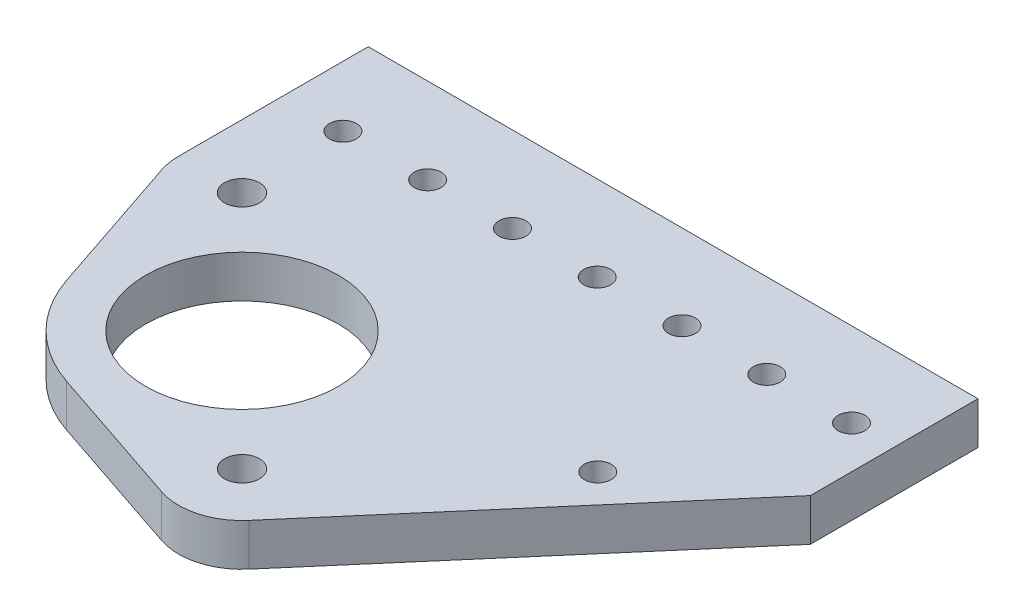
ISO-10303-21;
HEADER;
FILE_DESCRIPTION(('STEP AP214'),'2;1');
FILE_NAME('part.step','',(''),(''),'','','');
FILE_SCHEMA(('AUTOMOTIVE_DESIGN { 1 0 10303 214 1 1 1 1 }'));
ENDSEC;
DATA;
#1=APPLICATION_CONTEXT('core data for automotive mechanical design processes');
#2=APPLICATION_PROTOCOL_DEFINITION('international standard','automotive_design',2000,#1);
#3=PRODUCT_CONTEXT('',#1,'mechanical');
#4=PRODUCT('Part','Part','',(#3));
#5=PRODUCT_RELATED_PRODUCT_CATEGORY('part','',(#4));
#6=PRODUCT_DEFINITION_FORMATION('','',#4);
#7=PRODUCT_DEFINITION_CONTEXT('part definition',#1,'design');
#8=PRODUCT_DEFINITION('design','',#6,#7);
#9=PRODUCT_DEFINITION_SHAPE('','',#8);
#10=(LENGTH_UNIT() NAMED_UNIT(*) SI_UNIT(.MILLI.,.METRE.));
#11=(NAMED_UNIT(*) PLANE_ANGLE_UNIT() SI_UNIT($,.RADIAN.));
#12=(NAMED_UNIT(*) SI_UNIT($,.STERADIAN.) SOLID_ANGLE_UNIT());
#13=UNCERTAINTY_MEASURE_WITH_UNIT(LENGTH_MEASURE(1.E-05),#10,'distance_accuracy_value','');
#14=(GEOMETRIC_REPRESENTATION_CONTEXT(3) GLOBAL_UNCERTAINTY_ASSIGNED_CONTEXT((#13)) GLOBAL_UNIT_ASSIGNED_CONTEXT((#10,
#11,#12)) REPRESENTATION_CONTEXT('',''));
#15=CARTESIAN_POINT('',(0.,0.,0.));
#16=DIRECTION('',(0.,0.,1.));
#17=DIRECTION('',(1.,0.,0.));
#18=AXIS2_PLACEMENT_3D('',#15,#16,#17);
#19=CARTESIAN_POINT('',(-286.403393079359,6.35,-124.626425091432));
#20=DIRECTION('',(0.,-1.,0.));
#21=DIRECTION('',(0.,0.,-1.));
#22=AXIS2_PLACEMENT_3D('',#19,#20,#21);
#23=PLANE('',#22);
#24=CARTESIAN_POINT('',(-286.403393079359,6.35,-124.626425091432));
#25=DIRECTION('',(0.,1.,0.));
#26=DIRECTION('',(0.,0.,-1.));
#27=AXIS2_PLACEMENT_3D('',#24,#25,#26);
#28=CIRCLE('',#27,20.828);
#29=CARTESIAN_POINT('',(-306.146217949546,6.35,-117.991182055557));
#30=VERTEX_POINT('',#29);
#31=CARTESIAN_POINT('',(-293.038636115233,6.35,-104.883600221245));
#32=VERTEX_POINT('',#31);
#33=EDGE_CURVE('E173',#30,#32,#28,.T.);
#34=ORIENTED_EDGE('',*,*,#33,.T.);
#35=DIRECTION('',(0.94789825572245,0.,0.318573220466406));
#36=VECTOR('',#35,1.);
#37=CARTESIAN_POINT('',(-293.038636115233,6.35,-104.883600221245));
#38=LINE('',#37,#36);
#39=CARTESIAN_POINT('',(-271.477290762163,6.35,-97.6371819635376));
#40=VERTEX_POINT('',#39);
#41=EDGE_CURVE('E103',#32,#40,#38,.T.);
#42=ORIENTED_EDGE('',*,*,#41,.T.);
#43=CARTESIAN_POINT('',(-268.44288083722,6.35,-106.665912849294));
#44=DIRECTION('',(0.,1.,0.));
#45=DIRECTION('',(0.,0.,1.));
#46=AXIS2_PLACEMENT_3D('',#43,#44,#45);
#47=CIRCLE('',#46,9.52499999999985);
#48=CARTESIAN_POINT('',(-261.213202803624,6.35,-100.464511352008));
#49=VERTEX_POINT('',#48);
#50=EDGE_CURVE('E198',#40,#49,#47,.T.);
#51=ORIENTED_EDGE('',*,*,#50,.T.);
#52=DIRECTION('',(0.6510657739932,0.,-0.759021315863155));
#53=VECTOR('',#52,1.);
#54=CARTESIAN_POINT('',(-261.213202803624,6.35,-100.464511352008));
#55=LINE('',#54,#53);
#56=CARTESIAN_POINT('',(-222.249489345523,6.35,-145.88893733357));
#57=VERTEX_POINT('',#56);
#58=EDGE_CURVE('E216',#49,#57,#55,.T.);
#59=ORIENTED_EDGE('',*,*,#58,.T.);
#60=DIRECTION('',(2.32410125910559E-13,0.,-1.));
#61=VECTOR('',#60,1.);
#62=CARTESIAN_POINT('',(-222.249489345523,6.35,-145.88893733357));
#63=LINE('',#62,#61);
#64=CARTESIAN_POINT('',(-222.249489345517,6.35,-171.087609000533));
#65=VERTEX_POINT('',#64);
#66=EDGE_CURVE('E214',#57,#65,#63,.T.);
#67=ORIENTED_EDGE('',*,*,#66,.T.);
#68=DIRECTION('',(-1.,0.,0.));
#69=VECTOR('',#68,1.);
#70=CARTESIAN_POINT('',(-313.888905321497,6.35,-171.087609000533));
#71=LINE('',#70,#69);
#72=CARTESIAN_POINT('',(-313.888905321497,6.35,-171.087609000533));
#73=VERTEX_POINT('',#72);
#74=EDGE_CURVE('E125',#65,#73,#71,.T.);
#75=ORIENTED_EDGE('',*,*,#74,.T.);
#76=DIRECTION('',(0.,0.,1.));
#77=VECTOR('',#76,1.);
#78=CARTESIAN_POINT('',(-313.888905321497,6.35,-171.087609000533));
#79=LINE('',#78,#77);
#80=CARTESIAN_POINT('',(-313.888905321497,6.35,-142.58693733357));
#81=VERTEX_POINT('',#80);
#82=EDGE_CURVE('E119',#73,#81,#79,.T.);
#83=ORIENTED_EDGE('',*,*,#82,.T.);
#84=CARTESIAN_POINT('',(-304.363905321497,6.35,-142.58693733357));
#85=DIRECTION('',(0.,1.,0.));
#86=DIRECTION('',(0.,0.,1.));
#87=AXIS2_PLACEMENT_3D('',#84,#85,#86);
#88=CIRCLE('',#87,9.52500000000003);
#89=CARTESIAN_POINT('',(-313.392636207253,6.35,-139.552527408628));
#90=VERTEX_POINT('',#89);
#91=EDGE_CURVE('E123',#81,#90,#88,.T.);
#92=ORIENTED_EDGE('',*,*,#91,.T.);
#93=DIRECTION('',(0.318573220466416,0.,0.947898255722447));
#94=VECTOR('',#93,1.);
#95=CARTESIAN_POINT('',(-306.146217949546,6.35,-117.991182055557));
#96=LINE('',#95,#94);
#97=EDGE_CURVE('E57',#90,#30,#96,.T.);
#98=ORIENTED_EDGE('',*,*,#97,.T.);
#99=EDGE_LOOP('',(#34,#42,#51,#59,#67,#75,#83,#92,#98));
#100=FACE_BOUND('',#99,.T.);
#101=CARTESIAN_POINT('',(-228.599489345517,6.35,-158.427874667141));
#102=DIRECTION('',(0.,1.,0.));
#103=DIRECTION('',(0.,0.,1.));
#104=AXIS2_PLACEMENT_3D('',#101,#102,#103);
#105=CIRCLE('',#104,2.01929999999987);
#106=CARTESIAN_POINT('',(-228.599489345517,6.35,-156.408574667141));
#107=VERTEX_POINT('',#106);
#108=EDGE_CURVE('E152',#107,#107,#105,.T.);
#109=ORIENTED_EDGE('',*,*,#108,.F.);
#110=EDGE_LOOP('',(#109));
#111=FACE_BOUND('',#110,.T.);
#112=CARTESIAN_POINT('',(-241.299425513707,6.35,-158.387609000533));
#113=DIRECTION('',(0.,1.,0.));
#114=DIRECTION('',(0.,0.,1.));
#115=AXIS2_PLACEMENT_3D('',#112,#113,#114);
#116=CIRCLE('',#115,2.01929999999987);
#117=CARTESIAN_POINT('',(-241.299425513707,6.35,-156.368309000534));
#118=VERTEX_POINT('',#117);
#119=EDGE_CURVE('E232',#118,#118,#116,.T.);
#120=ORIENTED_EDGE('',*,*,#119,.F.);
#121=EDGE_LOOP('',(#120));
#122=FACE_BOUND('',#121,.T.);
#123=CARTESIAN_POINT('',(-253.999361681897,6.35,-158.347343333926));
#124=DIRECTION('',(0.,1.,0.));
#125=DIRECTION('',(0.,0.,1.));
#126=AXIS2_PLACEMENT_3D('',#123,#124,#125);
#127=CIRCLE('',#126,2.01929999999982);
#128=CARTESIAN_POINT('',(-253.999361681897,6.35,-156.328043333926));
#129=VERTEX_POINT('',#128);
#130=EDGE_CURVE('E240',#129,#129,#127,.T.);
#131=ORIENTED_EDGE('',*,*,#130,.F.);
#132=EDGE_LOOP('',(#131));
#133=FACE_BOUND('',#132,.T.);
#134=CARTESIAN_POINT('',(-266.699297850086,6.35,-158.307077667319));
#135=DIRECTION('',(0.,1.,0.));
#136=DIRECTION('',(0.,0.,1.));
#137=AXIS2_PLACEMENT_3D('',#134,#135,#136);
#138=CIRCLE('',#137,2.01929999999982);
#139=CARTESIAN_POINT('',(-266.699297850086,6.35,-156.287777667319));
#140=VERTEX_POINT('',#139);
#141=EDGE_CURVE('E248',#140,#140,#138,.T.);
#142=ORIENTED_EDGE('',*,*,#141,.F.);
#143=EDGE_LOOP('',(#142));
#144=FACE_BOUND('',#143,.T.);
#145=CARTESIAN_POINT('',(-279.399234018276,6.35,-158.266812000711));
#146=DIRECTION('',(0.,1.,0.));
#147=DIRECTION('',(0.,0.,1.));
#148=AXIS2_PLACEMENT_3D('',#145,#146,#147);
#149=CIRCLE('',#148,2.01929999999982);
#150=CARTESIAN_POINT('',(-279.399234018276,6.35,-156.247512000711));
#151=VERTEX_POINT('',#150);
#152=EDGE_CURVE('E256',#151,#151,#149,.T.);
#153=ORIENTED_EDGE('',*,*,#152,.F.);
#154=EDGE_LOOP('',(#153));
#155=FACE_BOUND('',#154,.T.);
#156=CARTESIAN_POINT('',(-292.099170186466,6.35,-158.226546334104));
#157=DIRECTION('',(0.,1.,0.));
#158=DIRECTION('',(0.,0.,1.));
#159=AXIS2_PLACEMENT_3D('',#156,#157,#158);
#160=CIRCLE('',#159,2.01929999999982);
#161=CARTESIAN_POINT('',(-292.099170186466,6.35,-156.207246334104));
#162=VERTEX_POINT('',#161);
#163=EDGE_CURVE('E264',#162,#162,#160,.T.);
#164=ORIENTED_EDGE('',*,*,#163,.F.);
#165=EDGE_LOOP('',(#164));
#166=FACE_BOUND('',#165,.T.);
#167=CARTESIAN_POINT('',(-304.799106354655,6.35,-158.186280667496));
#168=DIRECTION('',(0.,1.,0.));
#169=DIRECTION('',(0.,0.,1.));
#170=AXIS2_PLACEMENT_3D('',#167,#168,#169);
#171=CIRCLE('',#170,2.01929999999982);
#172=CARTESIAN_POINT('',(-304.799106354655,6.35,-156.166980667497));
#173=VERTEX_POINT('',#172);
#174=EDGE_CURVE('E272',#173,#173,#171,.T.);
#175=ORIENTED_EDGE('',*,*,#174,.F.);
#176=EDGE_LOOP('',(#175));
#177=FACE_BOUND('',#176,.T.);
#178=CARTESIAN_POINT('',(-268.44288083722,6.35,-106.665912849294));
#179=DIRECTION('',(0.,1.,0.));
#180=DIRECTION('',(0.,0.,1.));
#181=AXIS2_PLACEMENT_3D('',#178,#179,#180);
#182=CIRCLE('',#181,2.62889999999964);
#183=CARTESIAN_POINT('',(-268.44288083722,6.35,-104.037012849294));
#184=VERTEX_POINT('',#183);
#185=EDGE_CURVE('E280',#184,#184,#182,.T.);
#186=ORIENTED_EDGE('',*,*,#185,.F.);
#187=EDGE_LOOP('',(#186));
#188=FACE_BOUND('',#187,.T.);
#189=CARTESIAN_POINT('',(-286.403393079359,6.35,-124.626425091432));
#190=DIRECTION('',(0.,1.,0.));
#191=DIRECTION('',(0.,0.,1.));
#192=AXIS2_PLACEMENT_3D('',#189,#190,#191);
#193=CIRCLE('',#192,14.478);
#194=CARTESIAN_POINT('',(-286.403393079359,6.35,-110.148425091432));
#195=VERTEX_POINT('',#194);
#196=EDGE_CURVE('E288',#195,#195,#193,.T.);
#197=ORIENTED_EDGE('',*,*,#196,.F.);
#198=EDGE_LOOP('',(#197));
#199=FACE_BOUND('',#198,.T.);
#200=CARTESIAN_POINT('',(-304.363905321497,6.35,-142.58693733357));
#201=DIRECTION('',(0.,1.,0.));
#202=DIRECTION('',(0.,0.,1.));
#203=AXIS2_PLACEMENT_3D('',#200,#201,#202);
#204=CIRCLE('',#203,2.62889999999999);
#205=CARTESIAN_POINT('',(-304.363905321497,6.35,-139.95803733357));
#206=VERTEX_POINT('',#205);
#207=EDGE_CURVE('E296',#206,#206,#204,.T.);
#208=ORIENTED_EDGE('',*,*,#207,.F.);
#209=EDGE_LOOP('',(#208));
#210=FACE_BOUND('',#209,.T.);
#211=CARTESIAN_POINT('',(-241.299425513707,6.35,-132.987609000533));
#212=DIRECTION('',(0.,1.,0.));
#213=DIRECTION('',(0.,0.,1.));
#214=AXIS2_PLACEMENT_3D('',#211,#212,#213);
#215=CIRCLE('',#214,2.0193);
#216=CARTESIAN_POINT('',(-241.299425513707,6.35,-130.968309000533));
#217=VERTEX_POINT('',#216);
#218=EDGE_CURVE('E304',#217,#217,#215,.T.);
#219=ORIENTED_EDGE('',*,*,#218,.F.);
#220=EDGE_LOOP('',(#219));
#221=FACE_BOUND('',#220,.T.);
#222=ADVANCED_FACE('F39',(#100,#111,#122,#133,#144,#155,#166,#177,#188,#199,#210,#221),#23,.F.);
#223=CARTESIAN_POINT('',(-286.403393079359,0.,-124.626425091432));
#224=DIRECTION('',(0.,-1.,0.));
#225=DIRECTION('',(0.,0.,-1.));
#226=AXIS2_PLACEMENT_3D('',#223,#224,#225);
#227=PLANE('',#226);
#228=CARTESIAN_POINT('',(-304.363905321497,0.,-142.58693733357));
#229=DIRECTION('',(0.,1.,0.));
#230=DIRECTION('',(0.,0.,1.));
#231=AXIS2_PLACEMENT_3D('',#228,#229,#230);
#232=CIRCLE('',#231,2.62889999999999);
#233=CARTESIAN_POINT('',(-304.363905321497,0.,-139.95803733357));
#234=VERTEX_POINT('',#233);
#235=EDGE_CURVE('E300',#234,#234,#232,.T.);
#236=ORIENTED_EDGE('',*,*,#235,.T.);
#237=EDGE_LOOP('',(#236));
#238=FACE_BOUND('',#237,.T.);
#239=CARTESIAN_POINT('',(-268.44288083722,0.,-106.665912849294));
#240=DIRECTION('',(0.,1.,0.));
#241=DIRECTION('',(0.,0.,1.));
#242=AXIS2_PLACEMENT_3D('',#239,#240,#241);
#243=CIRCLE('',#242,2.62889999999964);
#244=CARTESIAN_POINT('',(-268.44288083722,0.,-104.037012849294));
#245=VERTEX_POINT('',#244);
#246=EDGE_CURVE('E284',#245,#245,#243,.T.);
#247=ORIENTED_EDGE('',*,*,#246,.T.);
#248=EDGE_LOOP('',(#247));
#249=FACE_BOUND('',#248,.T.);
#250=CARTESIAN_POINT('',(-292.099170186466,0.,-158.226546334104));
#251=DIRECTION('',(0.,1.,0.));
#252=DIRECTION('',(0.,0.,1.));
#253=AXIS2_PLACEMENT_3D('',#250,#251,#252);
#254=CIRCLE('',#253,2.01929999999982);
#255=CARTESIAN_POINT('',(-292.099170186466,0.,-156.207246334104));
#256=VERTEX_POINT('',#255);
#257=EDGE_CURVE('E268',#256,#256,#254,.T.);
#258=ORIENTED_EDGE('',*,*,#257,.T.);
#259=EDGE_LOOP('',(#258));
#260=FACE_BOUND('',#259,.T.);
#261=CARTESIAN_POINT('',(-266.699297850086,0.,-158.307077667319));
#262=DIRECTION('',(0.,1.,0.));
#263=DIRECTION('',(0.,0.,1.));
#264=AXIS2_PLACEMENT_3D('',#261,#262,#263);
#265=CIRCLE('',#264,2.01929999999982);
#266=CARTESIAN_POINT('',(-266.699297850086,0.,-156.287777667319));
#267=VERTEX_POINT('',#266);
#268=EDGE_CURVE('E252',#267,#267,#265,.T.);
#269=ORIENTED_EDGE('',*,*,#268,.T.);
#270=EDGE_LOOP('',(#269));
#271=FACE_BOUND('',#270,.T.);
#272=CARTESIAN_POINT('',(-241.299425513707,0.,-158.387609000533));
#273=DIRECTION('',(0.,1.,0.));
#274=DIRECTION('',(0.,0.,1.));
#275=AXIS2_PLACEMENT_3D('',#272,#273,#274);
#276=CIRCLE('',#275,2.01929999999987);
#277=CARTESIAN_POINT('',(-241.299425513707,0.,-156.368309000534));
#278=VERTEX_POINT('',#277);
#279=EDGE_CURVE('E236',#278,#278,#276,.T.);
#280=ORIENTED_EDGE('',*,*,#279,.T.);
#281=EDGE_LOOP('',(#280));
#282=FACE_BOUND('',#281,.T.);
#283=CARTESIAN_POINT('',(-286.403393079359,0.,-124.626425091432));
#284=DIRECTION('',(0.,1.,0.));
#285=DIRECTION('',(0.,0.,-1.));
#286=AXIS2_PLACEMENT_3D('',#283,#284,#285);
#287=CIRCLE('',#286,20.828);
#288=CARTESIAN_POINT('',(-306.146217949546,0.,-117.991182055557));
#289=VERTEX_POINT('',#288);
#290=CARTESIAN_POINT('',(-293.038636115233,0.,-104.883600221245));
#291=VERTEX_POINT('',#290);
#292=EDGE_CURVE('E147',#289,#291,#287,.T.);
#293=ORIENTED_EDGE('',*,*,#292,.F.);
#294=DIRECTION('',(0.318573220466416,0.,0.947898255722447));
#295=VECTOR('',#294,1.);
#296=CARTESIAN_POINT('',(-306.146217949546,0.,-117.991182055557));
#297=LINE('',#296,#295);
#298=CARTESIAN_POINT('',(-313.392636207253,0.,-139.552527408628));
#299=VERTEX_POINT('',#298);
#300=EDGE_CURVE('E95',#299,#289,#297,.T.);
#301=ORIENTED_EDGE('',*,*,#300,.F.);
#302=CARTESIAN_POINT('',(-304.363905321497,0.,-142.58693733357));
#303=DIRECTION('',(0.,1.,0.));
#304=DIRECTION('',(0.,0.,1.));
#305=AXIS2_PLACEMENT_3D('',#302,#303,#304);
#306=CIRCLE('',#305,9.52500000000003);
#307=CARTESIAN_POINT('',(-313.888905321497,0.,-142.58693733357));
#308=VERTEX_POINT('',#307);
#309=EDGE_CURVE('E89',#308,#299,#306,.T.);
#310=ORIENTED_EDGE('',*,*,#309,.F.);
#311=DIRECTION('',(0.,0.,1.));
#312=VECTOR('',#311,1.);
#313=CARTESIAN_POINT('',(-313.888905321497,0.,-171.087609000533));
#314=LINE('',#313,#312);
#315=CARTESIAN_POINT('',(-313.888905321497,0.,-171.087609000533));
#316=VERTEX_POINT('',#315);
#317=EDGE_CURVE('E134',#316,#308,#314,.T.);
#318=ORIENTED_EDGE('',*,*,#317,.F.);
#319=DIRECTION('',(-1.,0.,0.));
#320=VECTOR('',#319,1.);
#321=CARTESIAN_POINT('',(-313.888905321497,0.,-171.087609000533));
#322=LINE('',#321,#320);
#323=CARTESIAN_POINT('',(-222.249489345517,0.,-171.087609000533));
#324=VERTEX_POINT('',#323);
#325=EDGE_CURVE('E164',#324,#316,#322,.T.);
#326=ORIENTED_EDGE('',*,*,#325,.F.);
#327=DIRECTION('',(2.32410125910559E-13,0.,-1.));
#328=VECTOR('',#327,1.);
#329=CARTESIAN_POINT('',(-222.249489345523,0.,-145.88893733357));
#330=LINE('',#329,#328);
#331=CARTESIAN_POINT('',(-222.249489345523,0.,-145.88893733357));
#332=VERTEX_POINT('',#331);
#333=EDGE_CURVE('E161',#332,#324,#330,.T.);
#334=ORIENTED_EDGE('',*,*,#333,.F.);
#335=DIRECTION('',(0.6510657739932,0.,-0.759021315863155));
#336=VECTOR('',#335,1.);
#337=CARTESIAN_POINT('',(-261.213202803624,0.,-100.464511352008));
#338=LINE('',#337,#336);
#339=CARTESIAN_POINT('',(-261.213202803624,0.,-100.464511352008));
#340=VERTEX_POINT('',#339);
#341=EDGE_CURVE('E158',#340,#332,#338,.T.);
#342=ORIENTED_EDGE('',*,*,#341,.F.);
#343=CARTESIAN_POINT('',(-268.44288083722,0.,-106.665912849294));
#344=DIRECTION('',(0.,1.,0.));
#345=DIRECTION('',(0.,0.,1.));
#346=AXIS2_PLACEMENT_3D('',#343,#344,#345);
#347=CIRCLE('',#346,9.52499999999985);
#348=CARTESIAN_POINT('',(-271.477290762163,0.,-97.6371819635376));
#349=VERTEX_POINT('',#348);
#350=EDGE_CURVE('E155',#349,#340,#347,.T.);
#351=ORIENTED_EDGE('',*,*,#350,.F.);
#352=DIRECTION('',(0.94789825572245,0.,0.318573220466406));
#353=VECTOR('',#352,1.);
#354=CARTESIAN_POINT('',(-293.038636115233,0.,-104.883600221245));
#355=LINE('',#354,#353);
#356=EDGE_CURVE('E151',#291,#349,#355,.T.);
#357=ORIENTED_EDGE('',*,*,#356,.F.);
#358=EDGE_LOOP('',(#293,#301,#310,#318,#326,#334,#342,#351,#357));
#359=FACE_BOUND('',#358,.T.);
#360=CARTESIAN_POINT('',(-228.599489345517,0.,-158.427874667141));
#361=DIRECTION('',(0.,1.,0.));
#362=DIRECTION('',(0.,0.,1.));
#363=AXIS2_PLACEMENT_3D('',#360,#361,#362);
#364=CIRCLE('',#363,2.01929999999987);
#365=CARTESIAN_POINT('',(-228.599489345517,0.,-156.408574667141));
#366=VERTEX_POINT('',#365);
#367=EDGE_CURVE('E228',#366,#366,#364,.T.);
#368=ORIENTED_EDGE('',*,*,#367,.T.);
#369=EDGE_LOOP('',(#368));
#370=FACE_BOUND('',#369,.T.);
#371=CARTESIAN_POINT('',(-253.999361681897,0.,-158.347343333926));
#372=DIRECTION('',(0.,1.,0.));
#373=DIRECTION('',(0.,0.,1.));
#374=AXIS2_PLACEMENT_3D('',#371,#372,#373);
#375=CIRCLE('',#374,2.01929999999982);
#376=CARTESIAN_POINT('',(-253.999361681897,0.,-156.328043333926));
#377=VERTEX_POINT('',#376);
#378=EDGE_CURVE('E244',#377,#377,#375,.T.);
#379=ORIENTED_EDGE('',*,*,#378,.T.);
#380=EDGE_LOOP('',(#379));
#381=FACE_BOUND('',#380,.T.);
#382=CARTESIAN_POINT('',(-279.399234018276,0.,-158.266812000711));
#383=DIRECTION('',(0.,1.,0.));
#384=DIRECTION('',(0.,0.,1.));
#385=AXIS2_PLACEMENT_3D('',#382,#383,#384);
#386=CIRCLE('',#385,2.01929999999982);
#387=CARTESIAN_POINT('',(-279.399234018276,0.,-156.247512000711));
#388=VERTEX_POINT('',#387);
#389=EDGE_CURVE('E260',#388,#388,#386,.T.);
#390=ORIENTED_EDGE('',*,*,#389,.T.);
#391=EDGE_LOOP('',(#390));
#392=FACE_BOUND('',#391,.T.);
#393=CARTESIAN_POINT('',(-304.799106354655,0.,-158.186280667496));
#394=DIRECTION('',(0.,1.,0.));
#395=DIRECTION('',(0.,0.,1.));
#396=AXIS2_PLACEMENT_3D('',#393,#394,#395);
#397=CIRCLE('',#396,2.01929999999982);
#398=CARTESIAN_POINT('',(-304.799106354655,0.,-156.166980667497));
#399=VERTEX_POINT('',#398);
#400=EDGE_CURVE('E276',#399,#399,#397,.T.);
#401=ORIENTED_EDGE('',*,*,#400,.T.);
#402=EDGE_LOOP('',(#401));
#403=FACE_BOUND('',#402,.T.);
#404=CARTESIAN_POINT('',(-286.403393079359,0.,-124.626425091432));
#405=DIRECTION('',(0.,1.,0.));
#406=DIRECTION('',(0.,0.,1.));
#407=AXIS2_PLACEMENT_3D('',#404,#405,#406);
#408=CIRCLE('',#407,14.478);
#409=CARTESIAN_POINT('',(-286.403393079359,0.,-110.148425091432));
#410=VERTEX_POINT('',#409);
#411=EDGE_CURVE('E292',#410,#410,#408,.T.);
#412=ORIENTED_EDGE('',*,*,#411,.T.);
#413=EDGE_LOOP('',(#412));
#414=FACE_BOUND('',#413,.T.);
#415=CARTESIAN_POINT('',(-241.299425513707,0.,-132.987609000533));
#416=DIRECTION('',(0.,1.,0.));
#417=DIRECTION('',(0.,0.,1.));
#418=AXIS2_PLACEMENT_3D('',#415,#416,#417);
#419=CIRCLE('',#418,2.0193);
#420=CARTESIAN_POINT('',(-241.299425513707,0.,-130.968309000533));
#421=VERTEX_POINT('',#420);
#422=EDGE_CURVE('E308',#421,#421,#419,.T.);
#423=ORIENTED_EDGE('',*,*,#422,.T.);
#424=EDGE_LOOP('',(#423));
#425=FACE_BOUND('',#424,.T.);
#426=ADVANCED_FACE('F202',(#238,#249,#260,#271,#282,#359,#370,#381,#392,#403,#414,#425),#227,.T.);
#427=CARTESIAN_POINT('',(-286.403393079359,6.35,-124.626425091432));
#428=DIRECTION('',(0.,-1.,0.));
#429=DIRECTION('',(0.,0.,-1.));
#430=AXIS2_PLACEMENT_3D('',#427,#428,#429);
#431=CYLINDRICAL_SURFACE('',#430,20.828);
#432=ORIENTED_EDGE('',*,*,#292,.T.);
#433=DIRECTION('',(0.,-1.,0.));
#434=VECTOR('',#433,1.);
#435=CARTESIAN_POINT('',(-293.038636115233,6.35,-104.883600221245));
#436=LINE('',#435,#434);
#437=EDGE_CURVE('E11',#32,#291,#436,.T.);
#438=ORIENTED_EDGE('',*,*,#437,.F.);
#439=ORIENTED_EDGE('',*,*,#33,.F.);
#440=DIRECTION('',(0.,-1.,0.));
#441=VECTOR('',#440,1.);
#442=CARTESIAN_POINT('',(-306.146217949546,6.35,-117.991182055557));
#443=LINE('',#442,#441);
#444=EDGE_CURVE('E143',#30,#289,#443,.T.);
#445=ORIENTED_EDGE('',*,*,#444,.T.);
#446=EDGE_LOOP('',(#432,#438,#439,#445));
#447=FACE_BOUND('',#446,.T.);
#448=ADVANCED_FACE('F41',(#447),#431,.T.);
#449=CARTESIAN_POINT('',(-293.038636115233,6.35,-104.883600221245));
#450=DIRECTION('',(0.318573220466406,0.,-0.94789825572245));
#451=DIRECTION('',(-0.94789825572245,0.,-0.318573220466406));
#452=AXIS2_PLACEMENT_3D('',#449,#450,#451);
#453=PLANE('',#452);
#454=ORIENTED_EDGE('',*,*,#356,.T.);
#455=DIRECTION('',(0.,-1.,0.));
#456=VECTOR('',#455,1.);
#457=CARTESIAN_POINT('',(-271.477290762163,6.35,-97.6371819635376));
#458=LINE('',#457,#456);
#459=EDGE_CURVE('E49',#40,#349,#458,.T.);
#460=ORIENTED_EDGE('',*,*,#459,.F.);
#461=ORIENTED_EDGE('',*,*,#41,.F.);
#462=ORIENTED_EDGE('',*,*,#437,.T.);
#463=EDGE_LOOP('',(#454,#460,#461,#462));
#464=FACE_BOUND('',#463,.T.);
#465=ADVANCED_FACE('F346',(#464),#453,.F.);
#466=CARTESIAN_POINT('',(-268.44288083722,6.35,-106.665912849294));
#467=DIRECTION('',(0.,-1.,0.));
#468=DIRECTION('',(0.,0.,-1.));
#469=AXIS2_PLACEMENT_3D('',#466,#467,#468);
#470=CYLINDRICAL_SURFACE('',#469,9.52499999999985);
#471=ORIENTED_EDGE('',*,*,#350,.T.);
#472=DIRECTION('',(0.,-1.,0.));
#473=VECTOR('',#472,1.);
#474=CARTESIAN_POINT('',(-261.213202803624,6.35,-100.464511352008));
#475=LINE('',#474,#473);
#476=EDGE_CURVE('E188',#49,#340,#475,.T.);
#477=ORIENTED_EDGE('',*,*,#476,.F.);
#478=ORIENTED_EDGE('',*,*,#50,.F.);
#479=ORIENTED_EDGE('',*,*,#459,.T.);
#480=EDGE_LOOP('',(#471,#477,#478,#479));
#481=FACE_BOUND('',#480,.T.);
#482=ADVANCED_FACE('F196',(#481),#470,.T.);
#483=CARTESIAN_POINT('',(-261.213202803624,6.35,-100.464511352008));
#484=DIRECTION('',(-0.759021315863155,0.,-0.6510657739932));
#485=DIRECTION('',(-0.6510657739932,0.,0.759021315863155));
#486=AXIS2_PLACEMENT_3D('',#483,#484,#485);
#487=PLANE('',#486);
#488=ORIENTED_EDGE('',*,*,#341,.T.);
#489=DIRECTION('',(0.,-1.,0.));
#490=VECTOR('',#489,1.);
#491=CARTESIAN_POINT('',(-222.249489345523,6.35,-145.88893733357));
#492=LINE('',#491,#490);
#493=EDGE_CURVE('E184',#57,#332,#492,.T.);
#494=ORIENTED_EDGE('',*,*,#493,.F.);
#495=ORIENTED_EDGE('',*,*,#58,.F.);
#496=ORIENTED_EDGE('',*,*,#476,.T.);
#497=EDGE_LOOP('',(#488,#494,#495,#496));
#498=FACE_BOUND('',#497,.T.);
#499=ADVANCED_FACE('F208',(#498),#487,.F.);
#500=CARTESIAN_POINT('',(-222.249489345523,6.35,-145.88893733357));
#501=DIRECTION('',(-1.,0.,-2.32410125910559E-13));
#502=DIRECTION('',(-2.32410125910559E-13,0.,1.));
#503=AXIS2_PLACEMENT_3D('',#500,#501,#502);
#504=PLANE('',#503);
#505=ORIENTED_EDGE('',*,*,#333,.T.);
#506=DIRECTION('',(0.,-1.,0.));
#507=VECTOR('',#506,1.);
#508=CARTESIAN_POINT('',(-222.249489345517,6.35,-171.087609000533));
#509=LINE('',#508,#507);
#510=EDGE_CURVE('E180',#65,#324,#509,.T.);
#511=ORIENTED_EDGE('',*,*,#510,.F.);
#512=ORIENTED_EDGE('',*,*,#66,.F.);
#513=ORIENTED_EDGE('',*,*,#493,.T.);
#514=EDGE_LOOP('',(#505,#511,#512,#513));
#515=FACE_BOUND('',#514,.T.);
#516=ADVANCED_FACE('F212',(#515),#504,.F.);
#517=CARTESIAN_POINT('',(-313.888905321497,6.35,-171.087609000533));
#518=DIRECTION('',(0.,0.,1.));
#519=DIRECTION('',(1.,0.,0.));
#520=AXIS2_PLACEMENT_3D('',#517,#518,#519);
#521=PLANE('',#520);
#522=ORIENTED_EDGE('',*,*,#325,.T.);
#523=DIRECTION('',(0.,-1.,0.));
#524=VECTOR('',#523,1.);
#525=CARTESIAN_POINT('',(-313.888905321497,6.35,-171.087609000533));
#526=LINE('',#525,#524);
#527=EDGE_CURVE('E136',#73,#316,#526,.T.);
#528=ORIENTED_EDGE('',*,*,#527,.F.);
#529=ORIENTED_EDGE('',*,*,#74,.F.);
#530=ORIENTED_EDGE('',*,*,#510,.T.);
#531=EDGE_LOOP('',(#522,#528,#529,#530));
#532=FACE_BOUND('',#531,.T.);
#533=ADVANCED_FACE('F337',(#532),#521,.F.);
#534=CARTESIAN_POINT('',(-313.888905321497,6.35,-171.087609000533));
#535=DIRECTION('',(1.,0.,0.));
#536=DIRECTION('',(0.,0.,-1.));
#537=AXIS2_PLACEMENT_3D('',#534,#535,#536);
#538=PLANE('',#537);
#539=ORIENTED_EDGE('',*,*,#317,.T.);
#540=DIRECTION('',(0.,-1.,0.));
#541=VECTOR('',#540,1.);
#542=CARTESIAN_POINT('',(-313.888905321497,6.35,-142.58693733357));
#543=LINE('',#542,#541);
#544=EDGE_CURVE('E131',#81,#308,#543,.T.);
#545=ORIENTED_EDGE('',*,*,#544,.F.);
#546=ORIENTED_EDGE('',*,*,#82,.F.);
#547=ORIENTED_EDGE('',*,*,#527,.T.);
#548=EDGE_LOOP('',(#539,#545,#546,#547));
#549=FACE_BOUND('',#548,.T.);
#550=ADVANCED_FACE('F132',(#549),#538,.F.);
#551=CARTESIAN_POINT('',(-304.363905321497,6.35,-142.58693733357));
#552=DIRECTION('',(0.,-1.,0.));
#553=DIRECTION('',(0.,0.,-1.));
#554=AXIS2_PLACEMENT_3D('',#551,#552,#553);
#555=CYLINDRICAL_SURFACE('',#554,9.52500000000003);
#556=ORIENTED_EDGE('',*,*,#309,.T.);
#557=DIRECTION('',(0.,-1.,0.));
#558=VECTOR('',#557,1.);
#559=CARTESIAN_POINT('',(-313.392636207253,6.35,-139.552527408628));
#560=LINE('',#559,#558);
#561=EDGE_CURVE('E137',#90,#299,#560,.T.);
#562=ORIENTED_EDGE('',*,*,#561,.F.);
#563=ORIENTED_EDGE('',*,*,#91,.F.);
#564=ORIENTED_EDGE('',*,*,#544,.T.);
#565=EDGE_LOOP('',(#556,#562,#563,#564));
#566=FACE_BOUND('',#565,.T.);
#567=ADVANCED_FACE('F139',(#566),#555,.T.);
#568=CARTESIAN_POINT('',(-306.146217949546,6.35,-117.991182055557));
#569=DIRECTION('',(0.947898255722446,0.,-0.318573220466415));
#570=DIRECTION('',(-0.318573220466416,0.,-0.947898255722447));
#571=AXIS2_PLACEMENT_3D('',#568,#569,#570);
#572=PLANE('',#571);
#573=ORIENTED_EDGE('',*,*,#300,.T.);
#574=ORIENTED_EDGE('',*,*,#444,.F.);
#575=ORIENTED_EDGE('',*,*,#97,.F.);
#576=ORIENTED_EDGE('',*,*,#561,.T.);
#577=EDGE_LOOP('',(#573,#574,#575,#576));
#578=FACE_BOUND('',#577,.T.);
#579=ADVANCED_FACE('F330',(#578),#572,.F.);
#580=CARTESIAN_POINT('',(-228.599489345517,6.35,-158.427874667141));
#581=DIRECTION('',(0.,-1.,0.));
#582=DIRECTION('',(0.,0.,-1.));
#583=AXIS2_PLACEMENT_3D('',#580,#581,#582);
#584=CYLINDRICAL_SURFACE('',#583,2.01929999999987);
#585=ORIENTED_EDGE('',*,*,#108,.T.);
#586=EDGE_LOOP('',(#585));
#587=FACE_BOUND('',#586,.T.);
#588=ORIENTED_EDGE('',*,*,#367,.F.);
#589=EDGE_LOOP('',(#588));
#590=FACE_BOUND('',#589,.T.);
#591=ADVANCED_FACE('F327',(#587,#590),#584,.F.);
#592=CARTESIAN_POINT('',(-241.299425513707,6.35,-158.387609000533));
#593=DIRECTION('',(0.,-1.,0.));
#594=DIRECTION('',(0.,0.,-1.));
#595=AXIS2_PLACEMENT_3D('',#592,#593,#594);
#596=CYLINDRICAL_SURFACE('',#595,2.01929999999987);
#597=ORIENTED_EDGE('',*,*,#119,.T.);
#598=EDGE_LOOP('',(#597));
#599=FACE_BOUND('',#598,.T.);
#600=ORIENTED_EDGE('',*,*,#279,.F.);
#601=EDGE_LOOP('',(#600));
#602=FACE_BOUND('',#601,.T.);
#603=ADVANCED_FACE('F415',(#599,#602),#596,.F.);
#604=CARTESIAN_POINT('',(-253.999361681897,6.35,-158.347343333926));
#605=DIRECTION('',(0.,-1.,0.));
#606=DIRECTION('',(0.,0.,-1.));
#607=AXIS2_PLACEMENT_3D('',#604,#605,#606);
#608=CYLINDRICAL_SURFACE('',#607,2.01929999999982);
#609=ORIENTED_EDGE('',*,*,#130,.T.);
#610=EDGE_LOOP('',(#609));
#611=FACE_BOUND('',#610,.T.);
#612=ORIENTED_EDGE('',*,*,#378,.F.);
#613=EDGE_LOOP('',(#612));
#614=FACE_BOUND('',#613,.T.);
#615=ADVANCED_FACE('F423',(#611,#614),#608,.F.);
#616=CARTESIAN_POINT('',(-266.699297850086,6.35,-158.307077667319));
#617=DIRECTION('',(0.,-1.,0.));
#618=DIRECTION('',(0.,0.,-1.));
#619=AXIS2_PLACEMENT_3D('',#616,#617,#618);
#620=CYLINDRICAL_SURFACE('',#619,2.01929999999982);
#621=ORIENTED_EDGE('',*,*,#141,.T.);
#622=EDGE_LOOP('',(#621));
#623=FACE_BOUND('',#622,.T.);
#624=ORIENTED_EDGE('',*,*,#268,.F.);
#625=EDGE_LOOP('',(#624));
#626=FACE_BOUND('',#625,.T.);
#627=ADVANCED_FACE('F431',(#623,#626),#620,.F.);
#628=CARTESIAN_POINT('',(-279.399234018276,6.35,-158.266812000711));
#629=DIRECTION('',(0.,-1.,0.));
#630=DIRECTION('',(0.,0.,-1.));
#631=AXIS2_PLACEMENT_3D('',#628,#629,#630);
#632=CYLINDRICAL_SURFACE('',#631,2.01929999999982);
#633=ORIENTED_EDGE('',*,*,#152,.T.);
#634=EDGE_LOOP('',(#633));
#635=FACE_BOUND('',#634,.T.);
#636=ORIENTED_EDGE('',*,*,#389,.F.);
#637=EDGE_LOOP('',(#636));
#638=FACE_BOUND('',#637,.T.);
#639=ADVANCED_FACE('F440',(#635,#638),#632,.F.);
#640=CARTESIAN_POINT('',(-292.099170186466,6.35,-158.226546334104));
#641=DIRECTION('',(0.,-1.,0.));
#642=DIRECTION('',(0.,0.,-1.));
#643=AXIS2_PLACEMENT_3D('',#640,#641,#642);
#644=CYLINDRICAL_SURFACE('',#643,2.01929999999982);
#645=ORIENTED_EDGE('',*,*,#163,.T.);
#646=EDGE_LOOP('',(#645));
#647=FACE_BOUND('',#646,.T.);
#648=ORIENTED_EDGE('',*,*,#257,.F.);
#649=EDGE_LOOP('',(#648));
#650=FACE_BOUND('',#649,.T.);
#651=ADVANCED_FACE('F449',(#647,#650),#644,.F.);
#652=CARTESIAN_POINT('',(-304.799106354655,6.35,-158.186280667496));
#653=DIRECTION('',(0.,-1.,0.));
#654=DIRECTION('',(0.,0.,-1.));
#655=AXIS2_PLACEMENT_3D('',#652,#653,#654);
#656=CYLINDRICAL_SURFACE('',#655,2.01929999999982);
#657=ORIENTED_EDGE('',*,*,#174,.T.);
#658=EDGE_LOOP('',(#657));
#659=FACE_BOUND('',#658,.T.);
#660=ORIENTED_EDGE('',*,*,#400,.F.);
#661=EDGE_LOOP('',(#660));
#662=FACE_BOUND('',#661,.T.);
#663=ADVANCED_FACE('F458',(#659,#662),#656,.F.);
#664=CARTESIAN_POINT('',(-268.44288083722,6.35,-106.665912849294));
#665=DIRECTION('',(0.,-1.,0.));
#666=DIRECTION('',(0.,0.,-1.));
#667=AXIS2_PLACEMENT_3D('',#664,#665,#666);
#668=CYLINDRICAL_SURFACE('',#667,2.62889999999964);
#669=ORIENTED_EDGE('',*,*,#185,.T.);
#670=EDGE_LOOP('',(#669));
#671=FACE_BOUND('',#670,.T.);
#672=ORIENTED_EDGE('',*,*,#246,.F.);
#673=EDGE_LOOP('',(#672));
#674=FACE_BOUND('',#673,.T.);
#675=ADVANCED_FACE('F467',(#671,#674),#668,.F.);
#676=CARTESIAN_POINT('',(-286.403393079359,6.35,-124.626425091432));
#677=DIRECTION('',(0.,-1.,0.));
#678=DIRECTION('',(0.,0.,-1.));
#679=AXIS2_PLACEMENT_3D('',#676,#677,#678);
#680=CYLINDRICAL_SURFACE('',#679,14.478);
#681=ORIENTED_EDGE('',*,*,#196,.T.);
#682=EDGE_LOOP('',(#681));
#683=FACE_BOUND('',#682,.T.);
#684=ORIENTED_EDGE('',*,*,#411,.F.);
#685=EDGE_LOOP('',(#684));
#686=FACE_BOUND('',#685,.T.);
#687=ADVANCED_FACE('F476',(#683,#686),#680,.F.);
#688=CARTESIAN_POINT('',(-304.363905321497,6.35,-142.58693733357));
#689=DIRECTION('',(0.,-1.,0.));
#690=DIRECTION('',(0.,0.,-1.));
#691=AXIS2_PLACEMENT_3D('',#688,#689,#690);
#692=CYLINDRICAL_SURFACE('',#691,2.62889999999999);
#693=ORIENTED_EDGE('',*,*,#207,.T.);
#694=EDGE_LOOP('',(#693));
#695=FACE_BOUND('',#694,.T.);
#696=ORIENTED_EDGE('',*,*,#235,.F.);
#697=EDGE_LOOP('',(#696));
#698=FACE_BOUND('',#697,.T.);
#699=ADVANCED_FACE('F485',(#695,#698),#692,.F.);
#700=CARTESIAN_POINT('',(-241.299425513707,6.35,-132.987609000533));
#701=DIRECTION('',(0.,-1.,0.));
#702=DIRECTION('',(0.,0.,-1.));
#703=AXIS2_PLACEMENT_3D('',#700,#701,#702);
#704=CYLINDRICAL_SURFACE('',#703,2.0193);
#705=ORIENTED_EDGE('',*,*,#218,.T.);
#706=EDGE_LOOP('',(#705));
#707=FACE_BOUND('',#706,.T.);
#708=ORIENTED_EDGE('',*,*,#422,.F.);
#709=EDGE_LOOP('',(#708));
#710=FACE_BOUND('',#709,.T.);
#711=ADVANCED_FACE('F316',(#707,#710),#704,.F.);
#712=CLOSED_SHELL('',(#222,#426,#448,#465,#482,#499,#516,#533,#550,#567,#579,#591,#603,#615,
#627,#639,#651,#663,#675,#687,#699,#711));
#713=MANIFOLD_SOLID_BREP('B2',#712);
#714=ADVANCED_BREP_SHAPE_REPRESENTATION('',(#18,#713),#14);
#715=SHAPE_DEFINITION_REPRESENTATION(#9,#714);
ENDSEC;
END-ISO-10303-21;
